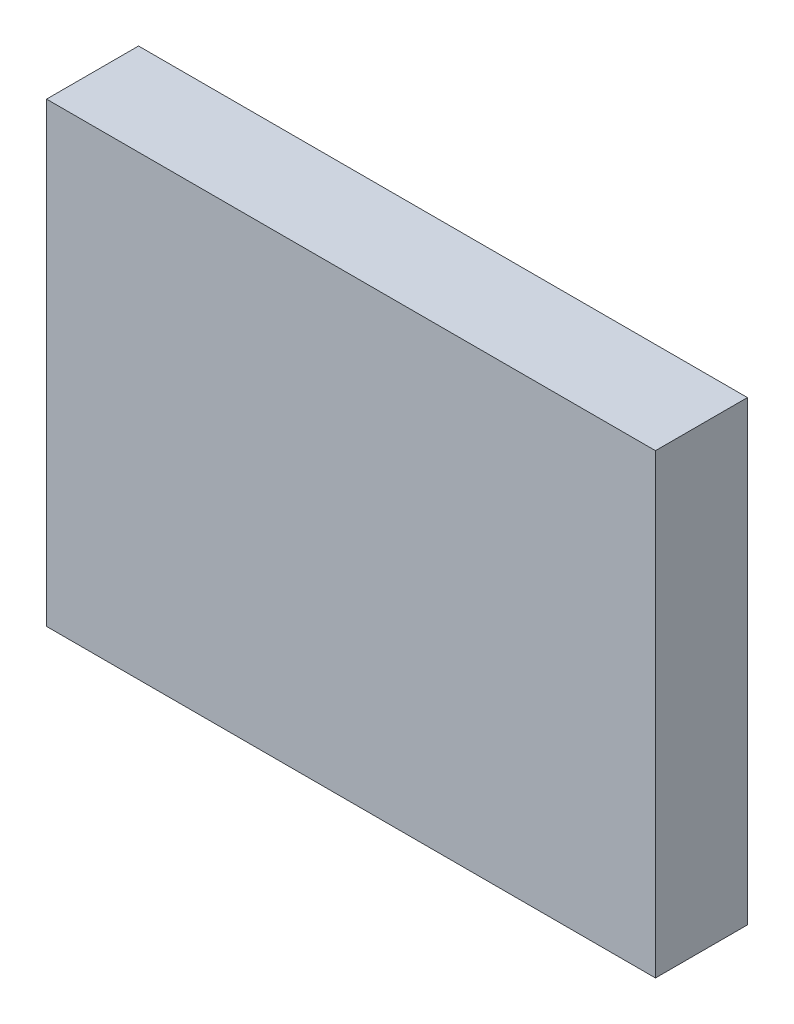
ISO-10303-21;
HEADER;
FILE_DESCRIPTION(('STEP AP214'),'2;1');
FILE_NAME('part.step','',(''),(''),'','','');
FILE_SCHEMA(('AUTOMOTIVE_DESIGN { 1 0 10303 214 1 1 1 1 }'));
ENDSEC;
DATA;
#1=APPLICATION_CONTEXT('core data for automotive mechanical design processes');
#2=APPLICATION_PROTOCOL_DEFINITION('international standard','automotive_design',2000,#1);
#3=PRODUCT_CONTEXT('',#1,'mechanical');
#4=PRODUCT('Part','Part','',(#3));
#5=PRODUCT_RELATED_PRODUCT_CATEGORY('part','',(#4));
#6=PRODUCT_DEFINITION_FORMATION('','',#4);
#7=PRODUCT_DEFINITION_CONTEXT('part definition',#1,'design');
#8=PRODUCT_DEFINITION('design','',#6,#7);
#9=PRODUCT_DEFINITION_SHAPE('','',#8);
#10=(LENGTH_UNIT() NAMED_UNIT(*) SI_UNIT(.MILLI.,.METRE.));
#11=(NAMED_UNIT(*) PLANE_ANGLE_UNIT() SI_UNIT($,.RADIAN.));
#12=(NAMED_UNIT(*) SI_UNIT($,.STERADIAN.) SOLID_ANGLE_UNIT());
#13=UNCERTAINTY_MEASURE_WITH_UNIT(LENGTH_MEASURE(1.E-05),#10,'distance_accuracy_value','');
#14=(GEOMETRIC_REPRESENTATION_CONTEXT(3) GLOBAL_UNCERTAINTY_ASSIGNED_CONTEXT((#13)) GLOBAL_UNIT_ASSIGNED_CONTEXT((#10,
#11,#12)) REPRESENTATION_CONTEXT('',''));
#15=CARTESIAN_POINT('',(0.,0.,0.));
#16=DIRECTION('',(0.,0.,1.));
#17=DIRECTION('',(1.,0.,0.));
#18=AXIS2_PLACEMENT_3D('',#15,#16,#17);
#19=CARTESIAN_POINT('',(2.4,-1.8,0.725));
#20=DIRECTION('',(-1.,0.,0.));
#21=DIRECTION('',(0.,0.,1.));
#22=AXIS2_PLACEMENT_3D('',#19,#20,#21);
#23=PLANE('',#22);
#24=DIRECTION('',(0.,1.,0.));
#25=VECTOR('',#24,1.);
#26=CARTESIAN_POINT('',(2.4,-1.8,0.));
#27=LINE('',#26,#25);
#28=CARTESIAN_POINT('',(2.4,-1.8,0.));
#29=VERTEX_POINT('',#28);
#30=CARTESIAN_POINT('',(2.4,1.8,0.));
#31=VERTEX_POINT('',#30);
#32=EDGE_CURVE('E100',#29,#31,#27,.T.);
#33=ORIENTED_EDGE('',*,*,#32,.T.);
#34=DIRECTION('',(0.,0.,-1.));
#35=VECTOR('',#34,1.);
#36=CARTESIAN_POINT('',(2.4,1.8,0.725));
#37=LINE('',#36,#35);
#38=CARTESIAN_POINT('',(2.4,1.8,0.725));
#39=VERTEX_POINT('',#38);
#40=EDGE_CURVE('E11',#39,#31,#37,.T.);
#41=ORIENTED_EDGE('',*,*,#40,.F.);
#42=DIRECTION('',(0.,1.,0.));
#43=VECTOR('',#42,1.);
#44=CARTESIAN_POINT('',(2.4,-1.8,0.725));
#45=LINE('',#44,#43);
#46=CARTESIAN_POINT('',(2.4,-1.8,0.725));
#47=VERTEX_POINT('',#46);
#48=EDGE_CURVE('E88',#47,#39,#45,.T.);
#49=ORIENTED_EDGE('',*,*,#48,.F.);
#50=DIRECTION('',(0.,0.,-1.));
#51=VECTOR('',#50,1.);
#52=CARTESIAN_POINT('',(2.4,-1.8,0.725));
#53=LINE('',#52,#51);
#54=EDGE_CURVE('E96',#47,#29,#53,.T.);
#55=ORIENTED_EDGE('',*,*,#54,.T.);
#56=EDGE_LOOP('',(#33,#41,#49,#55));
#57=FACE_BOUND('',#56,.T.);
#58=ADVANCED_FACE('F37',(#57),#23,.F.);
#59=CARTESIAN_POINT('',(-2.4,1.8,0.725));
#60=DIRECTION('',(0.,-1.,0.));
#61=DIRECTION('',(0.,0.,-1.));
#62=AXIS2_PLACEMENT_3D('',#59,#60,#61);
#63=PLANE('',#62);
#64=DIRECTION('',(-1.,0.,0.));
#65=VECTOR('',#64,1.);
#66=CARTESIAN_POINT('',(-2.4,1.8,0.));
#67=LINE('',#66,#65);
#68=CARTESIAN_POINT('',(-2.4,1.8,0.));
#69=VERTEX_POINT('',#68);
#70=EDGE_CURVE('E92',#31,#69,#67,.T.);
#71=ORIENTED_EDGE('',*,*,#70,.T.);
#72=DIRECTION('',(0.,0.,-1.));
#73=VECTOR('',#72,1.);
#74=CARTESIAN_POINT('',(-2.4,1.8,0.725));
#75=LINE('',#74,#73);
#76=CARTESIAN_POINT('',(-2.4,1.8,0.725));
#77=VERTEX_POINT('',#76);
#78=EDGE_CURVE('E45',#77,#69,#75,.T.);
#79=ORIENTED_EDGE('',*,*,#78,.F.);
#80=DIRECTION('',(-1.,0.,0.));
#81=VECTOR('',#80,1.);
#82=CARTESIAN_POINT('',(-2.4,1.8,0.725));
#83=LINE('',#82,#81);
#84=EDGE_CURVE('E83',#39,#77,#83,.T.);
#85=ORIENTED_EDGE('',*,*,#84,.F.);
#86=ORIENTED_EDGE('',*,*,#40,.T.);
#87=EDGE_LOOP('',(#71,#79,#85,#86));
#88=FACE_BOUND('',#87,.T.);
#89=ADVANCED_FACE('F91',(#88),#63,.F.);
#90=CARTESIAN_POINT('',(-2.4,-1.8,0.725));
#91=DIRECTION('',(1.,0.,0.));
#92=DIRECTION('',(0.,0.,-1.));
#93=AXIS2_PLACEMENT_3D('',#90,#91,#92);
#94=PLANE('',#93);
#95=DIRECTION('',(0.,-1.,0.));
#96=VECTOR('',#95,1.);
#97=CARTESIAN_POINT('',(-2.4,-1.8,0.));
#98=LINE('',#97,#96);
#99=CARTESIAN_POINT('',(-2.4,-1.8,0.));
#100=VERTEX_POINT('',#99);
#101=EDGE_CURVE('E70',#69,#100,#98,.T.);
#102=ORIENTED_EDGE('',*,*,#101,.T.);
#103=DIRECTION('',(0.,0.,-1.));
#104=VECTOR('',#103,1.);
#105=CARTESIAN_POINT('',(-2.4,-1.8,0.725));
#106=LINE('',#105,#104);
#107=CARTESIAN_POINT('',(-2.4,-1.8,0.725));
#108=VERTEX_POINT('',#107);
#109=EDGE_CURVE('E93',#108,#100,#106,.T.);
#110=ORIENTED_EDGE('',*,*,#109,.F.);
#111=DIRECTION('',(0.,-1.,0.));
#112=VECTOR('',#111,1.);
#113=CARTESIAN_POINT('',(-2.4,-1.8,0.725));
#114=LINE('',#113,#112);
#115=EDGE_CURVE('E86',#77,#108,#114,.T.);
#116=ORIENTED_EDGE('',*,*,#115,.F.);
#117=ORIENTED_EDGE('',*,*,#78,.T.);
#118=EDGE_LOOP('',(#102,#110,#116,#117));
#119=FACE_BOUND('',#118,.T.);
#120=ADVANCED_FACE('F94',(#119),#94,.F.);
#121=CARTESIAN_POINT('',(-2.4,-1.8,0.725));
#122=DIRECTION('',(0.,1.,0.));
#123=DIRECTION('',(0.,0.,1.));
#124=AXIS2_PLACEMENT_3D('',#121,#122,#123);
#125=PLANE('',#124);
#126=DIRECTION('',(1.,0.,0.));
#127=VECTOR('',#126,1.);
#128=CARTESIAN_POINT('',(-2.4,-1.8,0.));
#129=LINE('',#128,#127);
#130=EDGE_CURVE('E76',#100,#29,#129,.T.);
#131=ORIENTED_EDGE('',*,*,#130,.T.);
#132=ORIENTED_EDGE('',*,*,#54,.F.);
#133=DIRECTION('',(1.,0.,0.));
#134=VECTOR('',#133,1.);
#135=CARTESIAN_POINT('',(-2.4,-1.8,0.725));
#136=LINE('',#135,#134);
#137=EDGE_CURVE('E53',#108,#47,#136,.T.);
#138=ORIENTED_EDGE('',*,*,#137,.F.);
#139=ORIENTED_EDGE('',*,*,#109,.T.);
#140=EDGE_LOOP('',(#131,#132,#138,#139));
#141=FACE_BOUND('',#140,.T.);
#142=ADVANCED_FACE('F107',(#141),#125,.F.);
#143=CARTESIAN_POINT('',(0.,0.,0.725));
#144=DIRECTION('',(0.,0.,-1.));
#145=DIRECTION('',(-1.,0.,0.));
#146=AXIS2_PLACEMENT_3D('',#143,#144,#145);
#147=PLANE('',#146);
#148=ORIENTED_EDGE('',*,*,#48,.T.);
#149=ORIENTED_EDGE('',*,*,#84,.T.);
#150=ORIENTED_EDGE('',*,*,#115,.T.);
#151=ORIENTED_EDGE('',*,*,#137,.T.);
#152=EDGE_LOOP('',(#148,#149,#150,#151));
#153=FACE_BOUND('',#152,.T.);
#154=ADVANCED_FACE('F84',(#153),#147,.F.);
#155=CARTESIAN_POINT('',(0.,0.,0.));
#156=DIRECTION('',(0.,0.,-1.));
#157=DIRECTION('',(-1.,0.,0.));
#158=AXIS2_PLACEMENT_3D('',#155,#156,#157);
#159=PLANE('',#158);
#160=ORIENTED_EDGE('',*,*,#32,.F.);
#161=ORIENTED_EDGE('',*,*,#130,.F.);
#162=ORIENTED_EDGE('',*,*,#101,.F.);
#163=ORIENTED_EDGE('',*,*,#70,.F.);
#164=EDGE_LOOP('',(#160,#161,#162,#163));
#165=FACE_BOUND('',#164,.T.);
#166=ADVANCED_FACE('F110',(#165),#159,.T.);
#167=CLOSED_SHELL('',(#58,#89,#120,#142,#154,#166));
#168=MANIFOLD_SOLID_BREP('B2',#167);
#169=ADVANCED_BREP_SHAPE_REPRESENTATION('',(#18,#168),#14);
#170=SHAPE_DEFINITION_REPRESENTATION(#9,#169);
ENDSEC;
END-ISO-10303-21;
